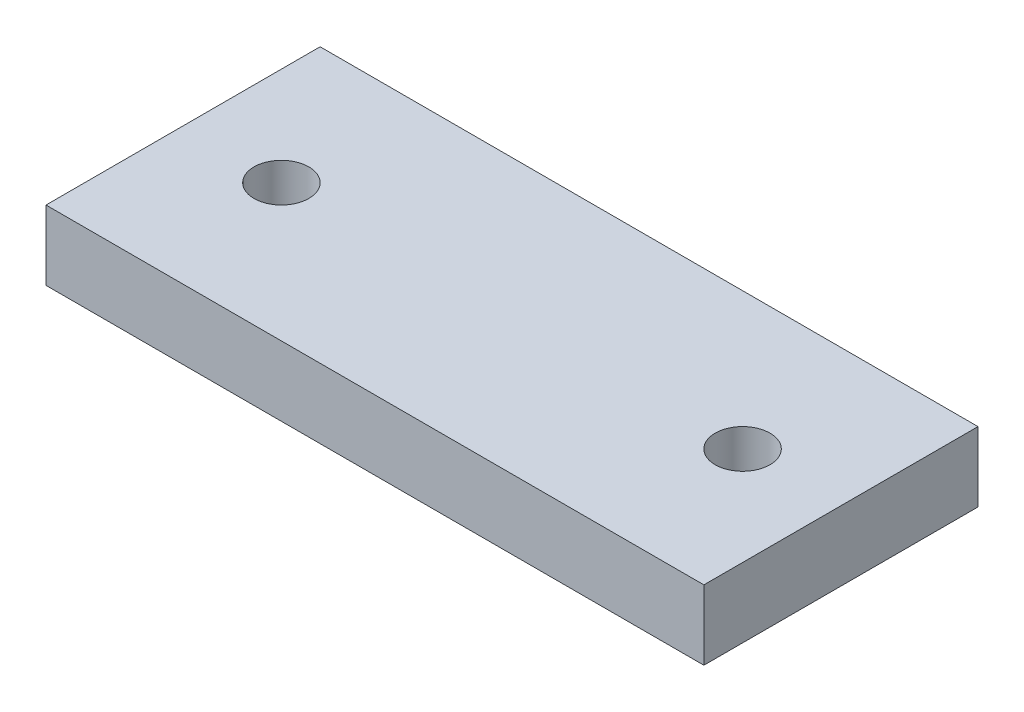
ISO-10303-21;
HEADER;
FILE_DESCRIPTION(('STEP AP214'),'2;1');
FILE_NAME('part.step','',(''),(''),'','','');
FILE_SCHEMA(('AUTOMOTIVE_DESIGN { 1 0 10303 214 1 1 1 1 }'));
ENDSEC;
DATA;
#1=APPLICATION_CONTEXT('core data for automotive mechanical design processes');
#2=APPLICATION_PROTOCOL_DEFINITION('international standard','automotive_design',2000,#1);
#3=PRODUCT_CONTEXT('',#1,'mechanical');
#4=PRODUCT('Part','Part','',(#3));
#5=PRODUCT_RELATED_PRODUCT_CATEGORY('part','',(#4));
#6=PRODUCT_DEFINITION_FORMATION('','',#4);
#7=PRODUCT_DEFINITION_CONTEXT('part definition',#1,'design');
#8=PRODUCT_DEFINITION('design','',#6,#7);
#9=PRODUCT_DEFINITION_SHAPE('','',#8);
#10=(LENGTH_UNIT() NAMED_UNIT(*) SI_UNIT(.MILLI.,.METRE.));
#11=(NAMED_UNIT(*) PLANE_ANGLE_UNIT() SI_UNIT($,.RADIAN.));
#12=(NAMED_UNIT(*) SI_UNIT($,.STERADIAN.) SOLID_ANGLE_UNIT());
#13=UNCERTAINTY_MEASURE_WITH_UNIT(LENGTH_MEASURE(1.E-05),#10,'distance_accuracy_value','');
#14=(GEOMETRIC_REPRESENTATION_CONTEXT(3) GLOBAL_UNCERTAINTY_ASSIGNED_CONTEXT((#13)) GLOBAL_UNIT_ASSIGNED_CONTEXT((#10,
#11,#12)) REPRESENTATION_CONTEXT('',''));
#15=CARTESIAN_POINT('',(0.,0.,0.));
#16=DIRECTION('',(0.,0.,1.));
#17=DIRECTION('',(1.,0.,0.));
#18=AXIS2_PLACEMENT_3D('',#15,#16,#17);
#19=CARTESIAN_POINT('',(0.,6.35,0.));
#20=DIRECTION('',(0.,-1.,0.));
#21=DIRECTION('',(0.,0.,-1.));
#22=AXIS2_PLACEMENT_3D('',#19,#20,#21);
#23=PLANE('',#22);
#24=DIRECTION('',(0.,0.,1.));
#25=VECTOR('',#24,1.);
#26=CARTESIAN_POINT('',(0.,6.35,0.));
#27=LINE('',#26,#25);
#28=CARTESIAN_POINT('',(0.,6.35,-25.));
#29=VERTEX_POINT('',#28);
#30=CARTESIAN_POINT('',(0.,6.35,0.));
#31=VERTEX_POINT('',#30);
#32=EDGE_CURVE('E84',#29,#31,#27,.T.);
#33=ORIENTED_EDGE('',*,*,#32,.T.);
#34=DIRECTION('',(1.,0.,0.));
#35=VECTOR('',#34,1.);
#36=CARTESIAN_POINT('',(0.,6.35,0.));
#37=LINE('',#36,#35);
#38=CARTESIAN_POINT('',(60.,6.35,0.));
#39=VERTEX_POINT('',#38);
#40=EDGE_CURVE('E79',#31,#39,#37,.T.);
#41=ORIENTED_EDGE('',*,*,#40,.T.);
#42=DIRECTION('',(0.,0.,-1.));
#43=VECTOR('',#42,1.);
#44=CARTESIAN_POINT('',(60.,6.35,0.));
#45=LINE('',#44,#43);
#46=CARTESIAN_POINT('',(60.,6.35,-25.));
#47=VERTEX_POINT('',#46);
#48=EDGE_CURVE('E82',#39,#47,#45,.T.);
#49=ORIENTED_EDGE('',*,*,#48,.T.);
#50=DIRECTION('',(-1.,0.,0.));
#51=VECTOR('',#50,1.);
#52=CARTESIAN_POINT('',(0.,6.35,-25.));
#53=LINE('',#52,#51);
#54=EDGE_CURVE('E49',#47,#29,#53,.T.);
#55=ORIENTED_EDGE('',*,*,#54,.T.);
#56=EDGE_LOOP('',(#33,#41,#49,#55));
#57=FACE_BOUND('',#56,.T.);
#58=CARTESIAN_POINT('',(8.97,6.35,-12.5));
#59=DIRECTION('',(0.,1.,0.));
#60=DIRECTION('',(0.,0.,1.));
#61=AXIS2_PLACEMENT_3D('',#58,#59,#60);
#62=CIRCLE('',#61,2.5);
#63=CARTESIAN_POINT('',(8.97,6.35,-10.));
#64=VERTEX_POINT('',#63);
#65=EDGE_CURVE('E99',#64,#64,#62,.T.);
#66=ORIENTED_EDGE('',*,*,#65,.F.);
#67=EDGE_LOOP('',(#66));
#68=FACE_BOUND('',#67,.T.);
#69=CARTESIAN_POINT('',(51.03,6.35,-12.5));
#70=DIRECTION('',(0.,1.,0.));
#71=DIRECTION('',(0.,0.,1.));
#72=AXIS2_PLACEMENT_3D('',#69,#70,#71);
#73=CIRCLE('',#72,2.5);
#74=CARTESIAN_POINT('',(51.03,6.35,-10.));
#75=VERTEX_POINT('',#74);
#76=EDGE_CURVE('E114',#75,#75,#73,.T.);
#77=ORIENTED_EDGE('',*,*,#76,.F.);
#78=EDGE_LOOP('',(#77));
#79=FACE_BOUND('',#78,.T.);
#80=ADVANCED_FACE('F32',(#57,#68,#79),#23,.F.);
#81=CARTESIAN_POINT('',(0.,0.,0.));
#82=DIRECTION('',(0.,-1.,0.));
#83=DIRECTION('',(0.,0.,-1.));
#84=AXIS2_PLACEMENT_3D('',#81,#82,#83);
#85=PLANE('',#84);
#86=CARTESIAN_POINT('',(8.97,0.,-12.5));
#87=DIRECTION('',(0.,1.,0.));
#88=DIRECTION('',(0.,0.,1.));
#89=AXIS2_PLACEMENT_3D('',#86,#87,#88);
#90=CIRCLE('',#89,2.5);
#91=CARTESIAN_POINT('',(8.97,0.,-10.));
#92=VERTEX_POINT('',#91);
#93=EDGE_CURVE('E111',#92,#92,#90,.T.);
#94=ORIENTED_EDGE('',*,*,#93,.T.);
#95=EDGE_LOOP('',(#94));
#96=FACE_BOUND('',#95,.T.);
#97=DIRECTION('',(0.,0.,1.));
#98=VECTOR('',#97,1.);
#99=CARTESIAN_POINT('',(0.,0.,0.));
#100=LINE('',#99,#98);
#101=CARTESIAN_POINT('',(0.,0.,-25.));
#102=VERTEX_POINT('',#101);
#103=CARTESIAN_POINT('',(0.,0.,0.));
#104=VERTEX_POINT('',#103);
#105=EDGE_CURVE('E96',#102,#104,#100,.T.);
#106=ORIENTED_EDGE('',*,*,#105,.F.);
#107=DIRECTION('',(-1.,0.,0.));
#108=VECTOR('',#107,1.);
#109=CARTESIAN_POINT('',(0.,0.,-25.));
#110=LINE('',#109,#108);
#111=CARTESIAN_POINT('',(60.,0.,-25.));
#112=VERTEX_POINT('',#111);
#113=EDGE_CURVE('E72',#112,#102,#110,.T.);
#114=ORIENTED_EDGE('',*,*,#113,.F.);
#115=DIRECTION('',(0.,0.,-1.));
#116=VECTOR('',#115,1.);
#117=CARTESIAN_POINT('',(60.,0.,0.));
#118=LINE('',#117,#116);
#119=CARTESIAN_POINT('',(60.,0.,0.));
#120=VERTEX_POINT('',#119);
#121=EDGE_CURVE('E66',#120,#112,#118,.T.);
#122=ORIENTED_EDGE('',*,*,#121,.F.);
#123=DIRECTION('',(1.,0.,0.));
#124=VECTOR('',#123,1.);
#125=CARTESIAN_POINT('',(0.,0.,0.));
#126=LINE('',#125,#124);
#127=EDGE_CURVE('E88',#104,#120,#126,.T.);
#128=ORIENTED_EDGE('',*,*,#127,.F.);
#129=EDGE_LOOP('',(#106,#114,#122,#128));
#130=FACE_BOUND('',#129,.T.);
#131=CARTESIAN_POINT('',(51.03,0.,-12.5));
#132=DIRECTION('',(0.,1.,0.));
#133=DIRECTION('',(0.,0.,1.));
#134=AXIS2_PLACEMENT_3D('',#131,#132,#133);
#135=CIRCLE('',#134,2.5);
#136=CARTESIAN_POINT('',(51.03,0.,-10.));
#137=VERTEX_POINT('',#136);
#138=EDGE_CURVE('E117',#137,#137,#135,.T.);
#139=ORIENTED_EDGE('',*,*,#138,.T.);
#140=EDGE_LOOP('',(#139));
#141=FACE_BOUND('',#140,.T.);
#142=ADVANCED_FACE('F107',(#96,#130,#141),#85,.T.);
#143=CARTESIAN_POINT('',(0.,6.35,0.));
#144=DIRECTION('',(1.,0.,0.));
#145=DIRECTION('',(0.,0.,-1.));
#146=AXIS2_PLACEMENT_3D('',#143,#144,#145);
#147=PLANE('',#146);
#148=ORIENTED_EDGE('',*,*,#105,.T.);
#149=DIRECTION('',(0.,-1.,0.));
#150=VECTOR('',#149,1.);
#151=CARTESIAN_POINT('',(0.,6.35,0.));
#152=LINE('',#151,#150);
#153=EDGE_CURVE('E11',#31,#104,#152,.T.);
#154=ORIENTED_EDGE('',*,*,#153,.F.);
#155=ORIENTED_EDGE('',*,*,#32,.F.);
#156=DIRECTION('',(0.,-1.,0.));
#157=VECTOR('',#156,1.);
#158=CARTESIAN_POINT('',(0.,6.35,-25.));
#159=LINE('',#158,#157);
#160=EDGE_CURVE('E92',#29,#102,#159,.T.);
#161=ORIENTED_EDGE('',*,*,#160,.T.);
#162=EDGE_LOOP('',(#148,#154,#155,#161));
#163=FACE_BOUND('',#162,.T.);
#164=ADVANCED_FACE('F34',(#163),#147,.F.);
#165=CARTESIAN_POINT('',(0.,6.35,0.));
#166=DIRECTION('',(0.,0.,-1.));
#167=DIRECTION('',(-1.,0.,0.));
#168=AXIS2_PLACEMENT_3D('',#165,#166,#167);
#169=PLANE('',#168);
#170=ORIENTED_EDGE('',*,*,#127,.T.);
#171=DIRECTION('',(0.,-1.,0.));
#172=VECTOR('',#171,1.);
#173=CARTESIAN_POINT('',(60.,6.35,0.));
#174=LINE('',#173,#172);
#175=EDGE_CURVE('E41',#39,#120,#174,.T.);
#176=ORIENTED_EDGE('',*,*,#175,.F.);
#177=ORIENTED_EDGE('',*,*,#40,.F.);
#178=ORIENTED_EDGE('',*,*,#153,.T.);
#179=EDGE_LOOP('',(#170,#176,#177,#178));
#180=FACE_BOUND('',#179,.T.);
#181=ADVANCED_FACE('F87',(#180),#169,.F.);
#182=CARTESIAN_POINT('',(60.,6.35,0.));
#183=DIRECTION('',(-1.,0.,0.));
#184=DIRECTION('',(0.,0.,1.));
#185=AXIS2_PLACEMENT_3D('',#182,#183,#184);
#186=PLANE('',#185);
#187=ORIENTED_EDGE('',*,*,#121,.T.);
#188=DIRECTION('',(0.,-1.,0.));
#189=VECTOR('',#188,1.);
#190=CARTESIAN_POINT('',(60.,6.35,-25.));
#191=LINE('',#190,#189);
#192=EDGE_CURVE('E89',#47,#112,#191,.T.);
#193=ORIENTED_EDGE('',*,*,#192,.F.);
#194=ORIENTED_EDGE('',*,*,#48,.F.);
#195=ORIENTED_EDGE('',*,*,#175,.T.);
#196=EDGE_LOOP('',(#187,#193,#194,#195));
#197=FACE_BOUND('',#196,.T.);
#198=ADVANCED_FACE('F90',(#197),#186,.F.);
#199=CARTESIAN_POINT('',(0.,6.35,-25.));
#200=DIRECTION('',(0.,0.,1.));
#201=DIRECTION('',(1.,0.,0.));
#202=AXIS2_PLACEMENT_3D('',#199,#200,#201);
#203=PLANE('',#202);
#204=ORIENTED_EDGE('',*,*,#113,.T.);
#205=ORIENTED_EDGE('',*,*,#160,.F.);
#206=ORIENTED_EDGE('',*,*,#54,.F.);
#207=ORIENTED_EDGE('',*,*,#192,.T.);
#208=EDGE_LOOP('',(#204,#205,#206,#207));
#209=FACE_BOUND('',#208,.T.);
#210=ADVANCED_FACE('F104',(#209),#203,.F.);
#211=CARTESIAN_POINT('',(8.97,6.35,-12.5));
#212=DIRECTION('',(0.,-1.,0.));
#213=DIRECTION('',(0.,0.,-1.));
#214=AXIS2_PLACEMENT_3D('',#211,#212,#213);
#215=CYLINDRICAL_SURFACE('',#214,2.5);
#216=ORIENTED_EDGE('',*,*,#65,.T.);
#217=EDGE_LOOP('',(#216));
#218=FACE_BOUND('',#217,.T.);
#219=ORIENTED_EDGE('',*,*,#93,.F.);
#220=EDGE_LOOP('',(#219));
#221=FACE_BOUND('',#220,.T.);
#222=ADVANCED_FACE('F134',(#218,#221),#215,.F.);
#223=CARTESIAN_POINT('',(51.03,6.35,-12.5));
#224=DIRECTION('',(0.,-1.,0.));
#225=DIRECTION('',(0.,0.,-1.));
#226=AXIS2_PLACEMENT_3D('',#223,#224,#225);
#227=CYLINDRICAL_SURFACE('',#226,2.5);
#228=ORIENTED_EDGE('',*,*,#76,.T.);
#229=EDGE_LOOP('',(#228));
#230=FACE_BOUND('',#229,.T.);
#231=ORIENTED_EDGE('',*,*,#138,.F.);
#232=EDGE_LOOP('',(#231));
#233=FACE_BOUND('',#232,.T.);
#234=ADVANCED_FACE('F123',(#230,#233),#227,.F.);
#235=CLOSED_SHELL('',(#80,#142,#164,#181,#198,#210,#222,#234));
#236=MANIFOLD_SOLID_BREP('B2',#235);
#237=ADVANCED_BREP_SHAPE_REPRESENTATION('',(#18,#236),#14);
#238=SHAPE_DEFINITION_REPRESENTATION(#9,#237);
ENDSEC;
END-ISO-10303-21;
